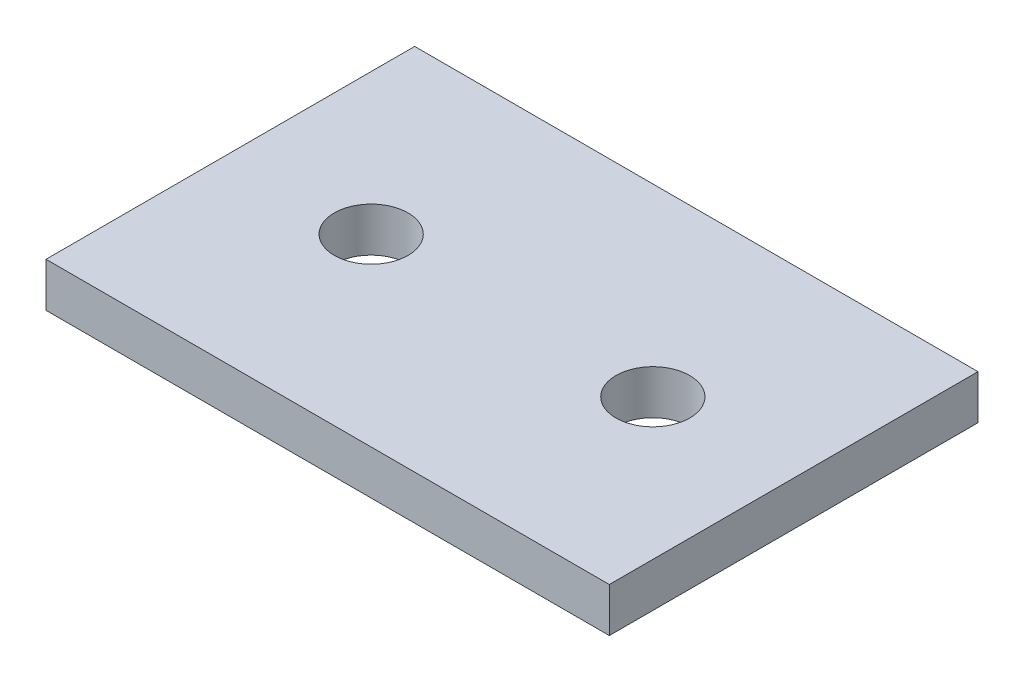
ISO-10303-21;
HEADER;
FILE_DESCRIPTION(('STEP AP214'),'2;1');
FILE_NAME('part.step','',(''),(''),'','','');
FILE_SCHEMA(('AUTOMOTIVE_DESIGN { 1 0 10303 214 1 1 1 1 }'));
ENDSEC;
DATA;
#1=APPLICATION_CONTEXT('core data for automotive mechanical design processes');
#2=APPLICATION_PROTOCOL_DEFINITION('international standard','automotive_design',2000,#1);
#3=PRODUCT_CONTEXT('',#1,'mechanical');
#4=PRODUCT('Part','Part','',(#3));
#5=PRODUCT_RELATED_PRODUCT_CATEGORY('part','',(#4));
#6=PRODUCT_DEFINITION_FORMATION('','',#4);
#7=PRODUCT_DEFINITION_CONTEXT('part definition',#1,'design');
#8=PRODUCT_DEFINITION('design','',#6,#7);
#9=PRODUCT_DEFINITION_SHAPE('','',#8);
#10=(LENGTH_UNIT() NAMED_UNIT(*) SI_UNIT(.MILLI.,.METRE.));
#11=(NAMED_UNIT(*) PLANE_ANGLE_UNIT() SI_UNIT($,.RADIAN.));
#12=(NAMED_UNIT(*) SI_UNIT($,.STERADIAN.) SOLID_ANGLE_UNIT());
#13=UNCERTAINTY_MEASURE_WITH_UNIT(LENGTH_MEASURE(1.E-05),#10,'distance_accuracy_value','');
#14=(GEOMETRIC_REPRESENTATION_CONTEXT(3) GLOBAL_UNCERTAINTY_ASSIGNED_CONTEXT((#13)) GLOBAL_UNIT_ASSIGNED_CONTEXT((#10,
#11,#12)) REPRESENTATION_CONTEXT('',''));
#15=CARTESIAN_POINT('',(0.,0.,0.));
#16=DIRECTION('',(0.,0.,1.));
#17=DIRECTION('',(1.,0.,0.));
#18=AXIS2_PLACEMENT_3D('',#15,#16,#17);
#19=CARTESIAN_POINT('',(0.,3.,0.));
#20=DIRECTION('',(0.,1.,0.));
#21=DIRECTION('',(0.,0.,1.));
#22=AXIS2_PLACEMENT_3D('',#19,#20,#21);
#23=PLANE('',#22);
#24=CARTESIAN_POINT('',(-9.55,3.,-12.5));
#25=DIRECTION('',(0.,-1.,0.));
#26=DIRECTION('',(0.,0.,-1.));
#27=AXIS2_PLACEMENT_3D('',#24,#25,#26);
#28=CIRCLE('',#27,2.5);
#29=CARTESIAN_POINT('',(-9.55,3.,-15.));
#30=VERTEX_POINT('',#29);
#31=EDGE_CURVE('E138',#30,#30,#28,.T.);
#32=ORIENTED_EDGE('',*,*,#31,.T.);
#33=EDGE_LOOP('',(#32));
#34=FACE_BOUND('',#33,.T.);
#35=DIRECTION('',(0.,0.,-1.));
#36=VECTOR('',#35,1.);
#37=CARTESIAN_POINT('',(0.,3.,0.));
#38=LINE('',#37,#36);
#39=CARTESIAN_POINT('',(0.,3.,0.));
#40=VERTEX_POINT('',#39);
#41=CARTESIAN_POINT('',(0.,3.,-25.));
#42=VERTEX_POINT('',#41);
#43=EDGE_CURVE('E96',#40,#42,#38,.T.);
#44=ORIENTED_EDGE('',*,*,#43,.T.);
#45=DIRECTION('',(-1.,0.,0.));
#46=VECTOR('',#45,1.);
#47=CARTESIAN_POINT('',(0.,3.,-25.));
#48=LINE('',#47,#46);
#49=CARTESIAN_POINT('',(-38.2,3.,-25.));
#50=VERTEX_POINT('',#49);
#51=EDGE_CURVE('E91',#42,#50,#48,.T.);
#52=ORIENTED_EDGE('',*,*,#51,.T.);
#53=DIRECTION('',(0.,0.,1.));
#54=VECTOR('',#53,1.);
#55=CARTESIAN_POINT('',(-38.2,3.,0.));
#56=LINE('',#55,#54);
#57=CARTESIAN_POINT('',(-38.2,3.,0.));
#58=VERTEX_POINT('',#57);
#59=EDGE_CURVE('E94',#50,#58,#56,.T.);
#60=ORIENTED_EDGE('',*,*,#59,.T.);
#61=DIRECTION('',(1.,0.,0.));
#62=VECTOR('',#61,1.);
#63=CARTESIAN_POINT('',(0.,3.,0.));
#64=LINE('',#63,#62);
#65=EDGE_CURVE('E61',#58,#40,#64,.T.);
#66=ORIENTED_EDGE('',*,*,#65,.T.);
#67=EDGE_LOOP('',(#44,#52,#60,#66));
#68=FACE_BOUND('',#67,.T.);
#69=CARTESIAN_POINT('',(-28.65,3.,-12.5));
#70=DIRECTION('',(0.,1.,0.));
#71=DIRECTION('',(0.,0.,1.));
#72=AXIS2_PLACEMENT_3D('',#69,#70,#71);
#73=CIRCLE('',#72,2.5);
#74=CARTESIAN_POINT('',(-28.65,3.,-10.));
#75=VERTEX_POINT('',#74);
#76=EDGE_CURVE('E142',#75,#75,#73,.T.);
#77=ORIENTED_EDGE('',*,*,#76,.F.);
#78=EDGE_LOOP('',(#77));
#79=FACE_BOUND('',#78,.T.);
#80=ADVANCED_FACE('F43',(#34,#68,#79),#23,.T.);
#81=CARTESIAN_POINT('',(0.,0.,0.));
#82=DIRECTION('',(0.,1.,0.));
#83=DIRECTION('',(0.,0.,1.));
#84=AXIS2_PLACEMENT_3D('',#81,#82,#83);
#85=PLANE('',#84);
#86=DIRECTION('',(0.,0.,-1.));
#87=VECTOR('',#86,1.);
#88=CARTESIAN_POINT('',(0.,0.,0.));
#89=LINE('',#88,#87);
#90=CARTESIAN_POINT('',(0.,0.,0.));
#91=VERTEX_POINT('',#90);
#92=CARTESIAN_POINT('',(0.,0.,-25.));
#93=VERTEX_POINT('',#92);
#94=EDGE_CURVE('E112',#91,#93,#89,.T.);
#95=ORIENTED_EDGE('',*,*,#94,.F.);
#96=DIRECTION('',(1.,0.,0.));
#97=VECTOR('',#96,1.);
#98=CARTESIAN_POINT('',(0.,0.,0.));
#99=LINE('',#98,#97);
#100=CARTESIAN_POINT('',(-38.2,0.,0.));
#101=VERTEX_POINT('',#100);
#102=EDGE_CURVE('E84',#101,#91,#99,.T.);
#103=ORIENTED_EDGE('',*,*,#102,.F.);
#104=DIRECTION('',(0.,0.,1.));
#105=VECTOR('',#104,1.);
#106=CARTESIAN_POINT('',(-38.2,0.,0.));
#107=LINE('',#106,#105);
#108=CARTESIAN_POINT('',(-38.2,0.,-25.));
#109=VERTEX_POINT('',#108);
#110=EDGE_CURVE('E78',#109,#101,#107,.T.);
#111=ORIENTED_EDGE('',*,*,#110,.F.);
#112=DIRECTION('',(-1.,0.,0.));
#113=VECTOR('',#112,1.);
#114=CARTESIAN_POINT('',(0.,0.,-25.));
#115=LINE('',#114,#113);
#116=EDGE_CURVE('E101',#93,#109,#115,.T.);
#117=ORIENTED_EDGE('',*,*,#116,.F.);
#118=EDGE_LOOP('',(#95,#103,#111,#117));
#119=FACE_BOUND('',#118,.T.);
#120=CARTESIAN_POINT('',(-9.55,0.,-12.5));
#121=DIRECTION('',(0.,-1.,0.));
#122=DIRECTION('',(0.,0.,-1.));
#123=AXIS2_PLACEMENT_3D('',#120,#121,#122);
#124=CIRCLE('',#123,2.5);
#125=CARTESIAN_POINT('',(-9.55,0.,-15.));
#126=VERTEX_POINT('',#125);
#127=EDGE_CURVE('E134',#126,#126,#124,.T.);
#128=ORIENTED_EDGE('',*,*,#127,.F.);
#129=EDGE_LOOP('',(#128));
#130=FACE_BOUND('',#129,.T.);
#131=CARTESIAN_POINT('',(-28.65,0.,-12.5));
#132=DIRECTION('',(0.,1.,0.));
#133=DIRECTION('',(0.,0.,1.));
#134=AXIS2_PLACEMENT_3D('',#131,#132,#133);
#135=CIRCLE('',#134,2.5);
#136=CARTESIAN_POINT('',(-28.65,0.,-10.));
#137=VERTEX_POINT('',#136);
#138=EDGE_CURVE('E116',#137,#137,#135,.T.);
#139=ORIENTED_EDGE('',*,*,#138,.T.);
#140=EDGE_LOOP('',(#139));
#141=FACE_BOUND('',#140,.T.);
#142=ADVANCED_FACE('F129',(#119,#130,#141),#85,.F.);
#143=CARTESIAN_POINT('',(0.,3.,0.));
#144=DIRECTION('',(-1.,0.,0.));
#145=DIRECTION('',(0.,0.,1.));
#146=AXIS2_PLACEMENT_3D('',#143,#144,#145);
#147=PLANE('',#146);
#148=ORIENTED_EDGE('',*,*,#94,.T.);
#149=DIRECTION('',(0.,-1.,0.));
#150=VECTOR('',#149,1.);
#151=CARTESIAN_POINT('',(0.,3.,-25.));
#152=LINE('',#151,#150);
#153=EDGE_CURVE('E11',#42,#93,#152,.T.);
#154=ORIENTED_EDGE('',*,*,#153,.F.);
#155=ORIENTED_EDGE('',*,*,#43,.F.);
#156=DIRECTION('',(0.,-1.,0.));
#157=VECTOR('',#156,1.);
#158=CARTESIAN_POINT('',(0.,3.,0.));
#159=LINE('',#158,#157);
#160=EDGE_CURVE('E108',#40,#91,#159,.T.);
#161=ORIENTED_EDGE('',*,*,#160,.T.);
#162=EDGE_LOOP('',(#148,#154,#155,#161));
#163=FACE_BOUND('',#162,.T.);
#164=ADVANCED_FACE('F45',(#163),#147,.F.);
#165=CARTESIAN_POINT('',(0.,3.,-25.));
#166=DIRECTION('',(0.,0.,1.));
#167=DIRECTION('',(1.,0.,0.));
#168=AXIS2_PLACEMENT_3D('',#165,#166,#167);
#169=PLANE('',#168);
#170=ORIENTED_EDGE('',*,*,#116,.T.);
#171=DIRECTION('',(0.,-1.,0.));
#172=VECTOR('',#171,1.);
#173=CARTESIAN_POINT('',(-38.2,3.,-25.));
#174=LINE('',#173,#172);
#175=EDGE_CURVE('E53',#50,#109,#174,.T.);
#176=ORIENTED_EDGE('',*,*,#175,.F.);
#177=ORIENTED_EDGE('',*,*,#51,.F.);
#178=ORIENTED_EDGE('',*,*,#153,.T.);
#179=EDGE_LOOP('',(#170,#176,#177,#178));
#180=FACE_BOUND('',#179,.T.);
#181=ADVANCED_FACE('F100',(#180),#169,.F.);
#182=CARTESIAN_POINT('',(-38.2,3.,0.));
#183=DIRECTION('',(1.,0.,0.));
#184=DIRECTION('',(0.,0.,-1.));
#185=AXIS2_PLACEMENT_3D('',#182,#183,#184);
#186=PLANE('',#185);
#187=ORIENTED_EDGE('',*,*,#110,.T.);
#188=DIRECTION('',(0.,-1.,0.));
#189=VECTOR('',#188,1.);
#190=CARTESIAN_POINT('',(-38.2,3.,0.));
#191=LINE('',#190,#189);
#192=EDGE_CURVE('E103',#58,#101,#191,.T.);
#193=ORIENTED_EDGE('',*,*,#192,.F.);
#194=ORIENTED_EDGE('',*,*,#59,.F.);
#195=ORIENTED_EDGE('',*,*,#175,.T.);
#196=EDGE_LOOP('',(#187,#193,#194,#195));
#197=FACE_BOUND('',#196,.T.);
#198=ADVANCED_FACE('F104',(#197),#186,.F.);
#199=CARTESIAN_POINT('',(0.,3.,0.));
#200=DIRECTION('',(0.,0.,-1.));
#201=DIRECTION('',(-1.,0.,0.));
#202=AXIS2_PLACEMENT_3D('',#199,#200,#201);
#203=PLANE('',#202);
#204=ORIENTED_EDGE('',*,*,#102,.T.);
#205=ORIENTED_EDGE('',*,*,#160,.F.);
#206=ORIENTED_EDGE('',*,*,#65,.F.);
#207=ORIENTED_EDGE('',*,*,#192,.T.);
#208=EDGE_LOOP('',(#204,#205,#206,#207));
#209=FACE_BOUND('',#208,.T.);
#210=ADVANCED_FACE('F126',(#209),#203,.F.);
#211=CARTESIAN_POINT('',(-9.55,0.,-12.5));
#212=DIRECTION('',(0.,1.,0.));
#213=DIRECTION('',(0.,0.,1.));
#214=AXIS2_PLACEMENT_3D('',#211,#212,#213);
#215=CYLINDRICAL_SURFACE('',#214,2.5);
#216=ORIENTED_EDGE('',*,*,#127,.T.);
#217=EDGE_LOOP('',(#216));
#218=FACE_BOUND('',#217,.T.);
#219=ORIENTED_EDGE('',*,*,#31,.F.);
#220=EDGE_LOOP('',(#219));
#221=FACE_BOUND('',#220,.T.);
#222=ADVANCED_FACE('F154',(#218,#221),#215,.F.);
#223=CARTESIAN_POINT('',(-28.65,0.,-12.5));
#224=DIRECTION('',(0.,1.,0.));
#225=DIRECTION('',(0.,0.,1.));
#226=AXIS2_PLACEMENT_3D('',#223,#224,#225);
#227=CYLINDRICAL_SURFACE('',#226,2.5);
#228=ORIENTED_EDGE('',*,*,#138,.F.);
#229=EDGE_LOOP('',(#228));
#230=FACE_BOUND('',#229,.T.);
#231=ORIENTED_EDGE('',*,*,#76,.T.);
#232=EDGE_LOOP('',(#231));
#233=FACE_BOUND('',#232,.T.);
#234=ADVANCED_FACE('F151',(#230,#233),#227,.F.);
#235=CLOSED_SHELL('',(#80,#142,#164,#181,#198,#210,#222,#234));
#236=MANIFOLD_SOLID_BREP('B2',#235);
#237=ADVANCED_BREP_SHAPE_REPRESENTATION('',(#18,#236),#14);
#238=SHAPE_DEFINITION_REPRESENTATION(#9,#237);
ENDSEC;
END-ISO-10303-21;
